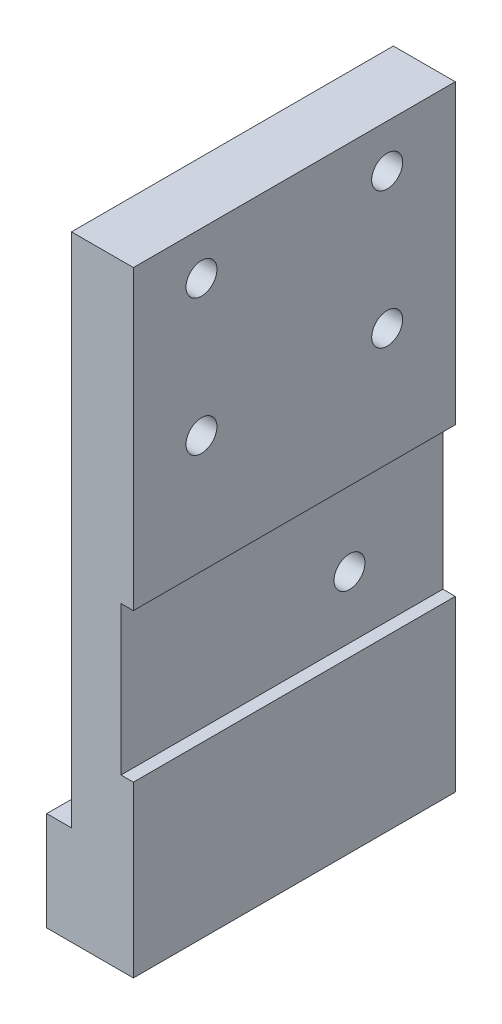
ISO-10303-21;
HEADER;
FILE_DESCRIPTION(('STEP AP214'),'2;1');
FILE_NAME('part.step','',(''),(''),'','','');
FILE_SCHEMA(('AUTOMOTIVE_DESIGN { 1 0 10303 214 1 1 1 1 }'));
ENDSEC;
DATA;
#1=APPLICATION_CONTEXT('core data for automotive mechanical design processes');
#2=APPLICATION_PROTOCOL_DEFINITION('international standard','automotive_design',2000,#1);
#3=PRODUCT_CONTEXT('',#1,'mechanical');
#4=PRODUCT('Part','Part','',(#3));
#5=PRODUCT_RELATED_PRODUCT_CATEGORY('part','',(#4));
#6=PRODUCT_DEFINITION_FORMATION('','',#4);
#7=PRODUCT_DEFINITION_CONTEXT('part definition',#1,'design');
#8=PRODUCT_DEFINITION('design','',#6,#7);
#9=PRODUCT_DEFINITION_SHAPE('','',#8);
#10=(LENGTH_UNIT() NAMED_UNIT(*) SI_UNIT(.MILLI.,.METRE.));
#11=(NAMED_UNIT(*) PLANE_ANGLE_UNIT() SI_UNIT($,.RADIAN.));
#12=(NAMED_UNIT(*) SI_UNIT($,.STERADIAN.) SOLID_ANGLE_UNIT());
#13=UNCERTAINTY_MEASURE_WITH_UNIT(LENGTH_MEASURE(1.E-05),#10,'distance_accuracy_value','');
#14=(GEOMETRIC_REPRESENTATION_CONTEXT(3) GLOBAL_UNCERTAINTY_ASSIGNED_CONTEXT((#13)) GLOBAL_UNIT_ASSIGNED_CONTEXT((#10,
#11,#12)) REPRESENTATION_CONTEXT('',''));
#15=CARTESIAN_POINT('',(0.,0.,0.));
#16=DIRECTION('',(0.,0.,1.));
#17=DIRECTION('',(1.,0.,0.));
#18=AXIS2_PLACEMENT_3D('',#15,#16,#17);
#19=CARTESIAN_POINT('',(22.4,54.,5.));
#20=DIRECTION('',(-1.,0.,0.));
#21=DIRECTION('',(0.,-1.,0.));
#22=AXIS2_PLACEMENT_3D('',#19,#20,#21);
#23=PLANE('',#22);
#24=DIRECTION('',(0.,-1.,0.));
#25=VECTOR('',#24,1.);
#26=CARTESIAN_POINT('',(22.4,36.7,-10.5));
#27=LINE('',#26,#25);
#28=CARTESIAN_POINT('',(22.4,18.7,-10.5));
#29=VERTEX_POINT('',#28);
#30=CARTESIAN_POINT('',(22.4,5.00000000000001,-10.5));
#31=VERTEX_POINT('',#30);
#32=EDGE_CURVE('E215',#29,#31,#27,.T.);
#33=ORIENTED_EDGE('',*,*,#32,.F.);
#34=DIRECTION('',(0.,0.,-1.));
#35=VECTOR('',#34,1.);
#36=CARTESIAN_POINT('',(22.4,18.7,-10.5));
#37=LINE('',#36,#35);
#38=CARTESIAN_POINT('',(22.4,18.7,15.5));
#39=VERTEX_POINT('',#38);
#40=EDGE_CURVE('E135',#39,#29,#37,.T.);
#41=ORIENTED_EDGE('',*,*,#40,.F.);
#42=DIRECTION('',(0.,1.,0.));
#43=VECTOR('',#42,1.);
#44=CARTESIAN_POINT('',(22.4,36.7,15.5));
#45=LINE('',#44,#43);
#46=CARTESIAN_POINT('',(22.4,5.00000000000001,15.5));
#47=VERTEX_POINT('',#46);
#48=EDGE_CURVE('E212',#47,#39,#45,.T.);
#49=ORIENTED_EDGE('',*,*,#48,.F.);
#50=DIRECTION('',(0.,0.,1.));
#51=VECTOR('',#50,1.);
#52=CARTESIAN_POINT('',(22.4,5.00000000000001,15.5));
#53=LINE('',#52,#51);
#54=EDGE_CURVE('E179',#31,#47,#53,.T.);
#55=ORIENTED_EDGE('',*,*,#54,.F.);
#56=EDGE_LOOP('',(#33,#41,#49,#55));
#57=FACE_BOUND('',#56,.T.);
#58=ADVANCED_FACE('F37',(#57),#23,.F.);
#59=CARTESIAN_POINT('',(17.4,54.,5.));
#60=DIRECTION('',(1.,0.,0.));
#61=DIRECTION('',(0.,1.,0.));
#62=AXIS2_PLACEMENT_3D('',#59,#60,#61);
#63=PLANE('',#62);
#64=CARTESIAN_POINT('',(17.4,23.7,-2.95567288440379));
#65=DIRECTION('',(1.,0.,0.));
#66=DIRECTION('',(0.,1.,0.));
#67=AXIS2_PLACEMENT_3D('',#64,#65,#66);
#68=CIRCLE('',#67,1.25);
#69=CARTESIAN_POINT('',(17.4,24.95,-2.95567288440379));
#70=VERTEX_POINT('',#69);
#71=EDGE_CURVE('E234',#70,#70,#68,.T.);
#72=ORIENTED_EDGE('',*,*,#71,.T.);
#73=EDGE_LOOP('',(#72));
#74=FACE_BOUND('',#73,.T.);
#75=CARTESIAN_POINT('',(17.4,51.1999999999982,10.));
#76=DIRECTION('',(1.,0.,0.));
#77=DIRECTION('',(0.,1.,0.));
#78=AXIS2_PLACEMENT_3D('',#75,#76,#77);
#79=CIRCLE('',#78,1.25);
#80=CARTESIAN_POINT('',(17.4,52.4499999999982,10.));
#81=VERTEX_POINT('',#80);
#82=EDGE_CURVE('E208',#81,#81,#79,.T.);
#83=ORIENTED_EDGE('',*,*,#82,.T.);
#84=EDGE_LOOP('',(#83));
#85=FACE_BOUND('',#84,.T.);
#86=CARTESIAN_POINT('',(17.4,51.1999999999982,-4.99999999999999));
#87=DIRECTION('',(1.,0.,0.));
#88=DIRECTION('',(0.,1.,0.));
#89=AXIS2_PLACEMENT_3D('',#86,#87,#88);
#90=CIRCLE('',#89,1.25);
#91=CARTESIAN_POINT('',(17.4,52.4499999999982,-4.99999999999999));
#92=VERTEX_POINT('',#91);
#93=EDGE_CURVE('E202',#92,#92,#90,.T.);
#94=ORIENTED_EDGE('',*,*,#93,.T.);
#95=EDGE_LOOP('',(#94));
#96=FACE_BOUND('',#95,.T.);
#97=CARTESIAN_POINT('',(17.4,40.1999999999982,-4.99999999999998));
#98=DIRECTION('',(1.,0.,0.));
#99=DIRECTION('',(0.,1.,0.));
#100=AXIS2_PLACEMENT_3D('',#97,#98,#99);
#101=CIRCLE('',#100,1.25);
#102=CARTESIAN_POINT('',(17.4,41.4499999999982,-4.99999999999998));
#103=VERTEX_POINT('',#102);
#104=EDGE_CURVE('E196',#103,#103,#101,.T.);
#105=ORIENTED_EDGE('',*,*,#104,.T.);
#106=EDGE_LOOP('',(#105));
#107=FACE_BOUND('',#106,.T.);
#108=CARTESIAN_POINT('',(17.4,40.1999999999982,10.));
#109=DIRECTION('',(1.,0.,0.));
#110=DIRECTION('',(0.,1.,0.));
#111=AXIS2_PLACEMENT_3D('',#108,#109,#110);
#112=CIRCLE('',#111,1.25);
#113=CARTESIAN_POINT('',(17.4,41.4499999999982,10.));
#114=VERTEX_POINT('',#113);
#115=EDGE_CURVE('E190',#114,#114,#112,.T.);
#116=ORIENTED_EDGE('',*,*,#115,.T.);
#117=EDGE_LOOP('',(#116));
#118=FACE_BOUND('',#117,.T.);
#119=DIRECTION('',(0.,0.,-1.));
#120=VECTOR('',#119,1.);
#121=CARTESIAN_POINT('',(17.4,13.,15.5));
#122=LINE('',#121,#120);
#123=CARTESIAN_POINT('',(17.4,13.,15.5));
#124=VERTEX_POINT('',#123);
#125=CARTESIAN_POINT('',(17.4,13.,-10.5));
#126=VERTEX_POINT('',#125);
#127=EDGE_CURVE('E60',#124,#126,#122,.T.);
#128=ORIENTED_EDGE('',*,*,#127,.F.);
#129=DIRECTION('',(0.,1.,0.));
#130=VECTOR('',#129,1.);
#131=CARTESIAN_POINT('',(17.4,36.7,15.5));
#132=LINE('',#131,#130);
#133=CARTESIAN_POINT('',(17.4,54.7,15.5));
#134=VERTEX_POINT('',#133);
#135=EDGE_CURVE('E211',#124,#134,#132,.T.);
#136=ORIENTED_EDGE('',*,*,#135,.T.);
#137=DIRECTION('',(0.,0.,1.));
#138=VECTOR('',#137,1.);
#139=CARTESIAN_POINT('',(17.4,54.7,5.));
#140=LINE('',#139,#138);
#141=CARTESIAN_POINT('',(17.4,54.7,-10.5));
#142=VERTEX_POINT('',#141);
#143=EDGE_CURVE('E11',#142,#134,#140,.T.);
#144=ORIENTED_EDGE('',*,*,#143,.F.);
#145=DIRECTION('',(0.,-1.,0.));
#146=VECTOR('',#145,1.);
#147=CARTESIAN_POINT('',(17.4,36.7,-10.5));
#148=LINE('',#147,#146);
#149=EDGE_CURVE('E220',#142,#126,#148,.T.);
#150=ORIENTED_EDGE('',*,*,#149,.T.);
#151=EDGE_LOOP('',(#128,#136,#144,#150));
#152=FACE_BOUND('',#151,.T.);
#153=ADVANCED_FACE('F263',(#74,#85,#96,#107,#118,#152),#63,.F.);
#154=CARTESIAN_POINT('',(22.4,40.1999999999982,10.));
#155=DIRECTION('',(1.,0.,0.));
#156=DIRECTION('',(0.,0.,-1.));
#157=AXIS2_PLACEMENT_3D('',#154,#155,#156);
#158=CIRCLE('',#157,1.25);
#159=CARTESIAN_POINT('',(22.4,40.1999999999982,8.75000000000001));
#160=VERTEX_POINT('',#159);
#161=EDGE_CURVE('E187',#160,#160,#158,.T.);
#162=ORIENTED_EDGE('',*,*,#161,.F.);
#163=EDGE_LOOP('',(#162));
#164=FACE_BOUND('',#163,.T.);
#165=CARTESIAN_POINT('',(22.4,40.1999999999982,-4.99999999999998));
#166=DIRECTION('',(1.,0.,0.));
#167=DIRECTION('',(0.,0.,-1.));
#168=AXIS2_PLACEMENT_3D('',#165,#166,#167);
#169=CIRCLE('',#168,1.25);
#170=CARTESIAN_POINT('',(22.4,40.1999999999982,-6.24999999999998));
#171=VERTEX_POINT('',#170);
#172=EDGE_CURVE('E193',#171,#171,#169,.T.);
#173=ORIENTED_EDGE('',*,*,#172,.F.);
#174=EDGE_LOOP('',(#173));
#175=FACE_BOUND('',#174,.T.);
#176=CARTESIAN_POINT('',(22.4,51.1999999999982,-4.99999999999999));
#177=DIRECTION('',(1.,0.,0.));
#178=DIRECTION('',(0.,0.,-1.));
#179=AXIS2_PLACEMENT_3D('',#176,#177,#178);
#180=CIRCLE('',#179,1.25);
#181=CARTESIAN_POINT('',(22.4,51.1999999999982,-6.24999999999999));
#182=VERTEX_POINT('',#181);
#183=EDGE_CURVE('E199',#182,#182,#180,.T.);
#184=ORIENTED_EDGE('',*,*,#183,.F.);
#185=EDGE_LOOP('',(#184));
#186=FACE_BOUND('',#185,.T.);
#187=CARTESIAN_POINT('',(22.4,51.1999999999982,10.));
#188=DIRECTION('',(1.,0.,0.));
#189=DIRECTION('',(0.,0.,-1.));
#190=AXIS2_PLACEMENT_3D('',#187,#188,#189);
#191=CIRCLE('',#190,1.25);
#192=CARTESIAN_POINT('',(22.4,51.1999999999982,8.75000000000001));
#193=VERTEX_POINT('',#192);
#194=EDGE_CURVE('E205',#193,#193,#191,.T.);
#195=ORIENTED_EDGE('',*,*,#194,.F.);
#196=EDGE_LOOP('',(#195));
#197=FACE_BOUND('',#196,.T.);
#198=CARTESIAN_POINT('',(22.4,30.7,15.5));
#199=VERTEX_POINT('',#198);
#200=CARTESIAN_POINT('',(22.4,54.7,15.5));
#201=VERTEX_POINT('',#200);
#202=EDGE_CURVE('E216',#199,#201,#45,.T.);
#203=ORIENTED_EDGE('',*,*,#202,.F.);
#204=DIRECTION('',(0.,0.,1.));
#205=VECTOR('',#204,1.);
#206=CARTESIAN_POINT('',(22.4,30.7,-10.5));
#207=LINE('',#206,#205);
#208=CARTESIAN_POINT('',(22.4,30.7,-10.5));
#209=VERTEX_POINT('',#208);
#210=EDGE_CURVE('E233',#209,#199,#207,.T.);
#211=ORIENTED_EDGE('',*,*,#210,.F.);
#212=CARTESIAN_POINT('',(22.4,54.7,-10.5));
#213=VERTEX_POINT('',#212);
#214=EDGE_CURVE('E141',#213,#209,#27,.T.);
#215=ORIENTED_EDGE('',*,*,#214,.F.);
#216=DIRECTION('',(0.,0.,-1.));
#217=VECTOR('',#216,1.);
#218=CARTESIAN_POINT('',(22.4,54.7,5.));
#219=LINE('',#218,#217);
#220=EDGE_CURVE('E45',#201,#213,#219,.T.);
#221=ORIENTED_EDGE('',*,*,#220,.F.);
#222=EDGE_LOOP('',(#203,#211,#215,#221));
#223=FACE_BOUND('',#222,.T.);
#224=ADVANCED_FACE('F39',(#164,#175,#186,#197,#223),#23,.F.);
#225=CARTESIAN_POINT('',(0.,54.7,0.));
#226=DIRECTION('',(0.,1.,0.));
#227=DIRECTION('',(0.,0.,1.));
#228=AXIS2_PLACEMENT_3D('',#225,#226,#227);
#229=PLANE('',#228);
#230=ORIENTED_EDGE('',*,*,#220,.T.);
#231=DIRECTION('',(-1.,0.,0.));
#232=VECTOR('',#231,1.);
#233=CARTESIAN_POINT('',(22.4,54.7,-10.5));
#234=LINE('',#233,#232);
#235=EDGE_CURVE('E222',#213,#142,#234,.T.);
#236=ORIENTED_EDGE('',*,*,#235,.T.);
#237=ORIENTED_EDGE('',*,*,#143,.T.);
#238=DIRECTION('',(-1.,0.,0.));
#239=VECTOR('',#238,1.);
#240=CARTESIAN_POINT('',(22.4,54.7,15.5));
#241=LINE('',#240,#239);
#242=EDGE_CURVE('E218',#201,#134,#241,.T.);
#243=ORIENTED_EDGE('',*,*,#242,.F.);
#244=EDGE_LOOP('',(#230,#236,#237,#243));
#245=FACE_BOUND('',#244,.T.);
#246=ADVANCED_FACE('F229',(#245),#229,.T.);
#247=CARTESIAN_POINT('',(22.4,36.7,-10.5));
#248=DIRECTION('',(0.,0.,-1.));
#249=DIRECTION('',(-1.,0.,0.));
#250=AXIS2_PLACEMENT_3D('',#247,#248,#249);
#251=PLANE('',#250);
#252=DIRECTION('',(1.,0.,0.));
#253=VECTOR('',#252,1.);
#254=CARTESIAN_POINT('',(21.4,18.7,-10.5));
#255=LINE('',#254,#253);
#256=CARTESIAN_POINT('',(21.4,18.7,-10.5));
#257=VERTEX_POINT('',#256);
#258=EDGE_CURVE('E152',#257,#29,#255,.T.);
#259=ORIENTED_EDGE('',*,*,#258,.T.);
#260=ORIENTED_EDGE('',*,*,#32,.T.);
#261=DIRECTION('',(1.,0.,0.));
#262=VECTOR('',#261,1.);
#263=CARTESIAN_POINT('',(22.4,5.00000000000001,-10.5));
#264=LINE('',#263,#262);
#265=CARTESIAN_POINT('',(15.4,5.00000000000001,-10.5));
#266=VERTEX_POINT('',#265);
#267=EDGE_CURVE('E184',#266,#31,#264,.T.);
#268=ORIENTED_EDGE('',*,*,#267,.F.);
#269=DIRECTION('',(0.,-1.,0.));
#270=VECTOR('',#269,1.);
#271=CARTESIAN_POINT('',(15.4,5.00000000000001,-10.5));
#272=LINE('',#271,#270);
#273=CARTESIAN_POINT('',(15.4,13.,-10.5));
#274=VERTEX_POINT('',#273);
#275=EDGE_CURVE('E166',#274,#266,#272,.T.);
#276=ORIENTED_EDGE('',*,*,#275,.F.);
#277=DIRECTION('',(1.,0.,0.));
#278=VECTOR('',#277,1.);
#279=CARTESIAN_POINT('',(15.4,13.,-10.5));
#280=LINE('',#279,#278);
#281=EDGE_CURVE('E172',#274,#126,#280,.T.);
#282=ORIENTED_EDGE('',*,*,#281,.T.);
#283=ORIENTED_EDGE('',*,*,#149,.F.);
#284=ORIENTED_EDGE('',*,*,#235,.F.);
#285=ORIENTED_EDGE('',*,*,#214,.T.);
#286=DIRECTION('',(1.,0.,0.));
#287=VECTOR('',#286,1.);
#288=CARTESIAN_POINT('',(21.4,30.7,-10.5));
#289=LINE('',#288,#287);
#290=CARTESIAN_POINT('',(21.4,30.7,-10.5));
#291=VERTEX_POINT('',#290);
#292=EDGE_CURVE('E120',#291,#209,#289,.T.);
#293=ORIENTED_EDGE('',*,*,#292,.F.);
#294=DIRECTION('',(0.,1.,0.));
#295=VECTOR('',#294,1.);
#296=CARTESIAN_POINT('',(21.4,18.7,-10.5));
#297=LINE('',#296,#295);
#298=EDGE_CURVE('E126',#257,#291,#297,.T.);
#299=ORIENTED_EDGE('',*,*,#298,.F.);
#300=EDGE_LOOP('',(#259,#260,#268,#276,#282,#283,#284,#285,#293,#299));
#301=FACE_BOUND('',#300,.T.);
#302=ADVANCED_FACE('F138',(#301),#251,.T.);
#303=CARTESIAN_POINT('',(22.4,36.7,15.5));
#304=DIRECTION('',(0.,0.,1.));
#305=DIRECTION('',(0.,-1.,0.));
#306=AXIS2_PLACEMENT_3D('',#303,#304,#305);
#307=PLANE('',#306);
#308=DIRECTION('',(1.,0.,0.));
#309=VECTOR('',#308,1.);
#310=CARTESIAN_POINT('',(21.4,18.7,15.5));
#311=LINE('',#310,#309);
#312=CARTESIAN_POINT('',(21.4,18.7,15.5));
#313=VERTEX_POINT('',#312);
#314=EDGE_CURVE('E143',#313,#39,#311,.T.);
#315=ORIENTED_EDGE('',*,*,#314,.F.);
#316=DIRECTION('',(0.,-1.,0.));
#317=VECTOR('',#316,1.);
#318=CARTESIAN_POINT('',(21.4,18.7,15.5));
#319=LINE('',#318,#317);
#320=CARTESIAN_POINT('',(21.4,30.7,15.5));
#321=VERTEX_POINT('',#320);
#322=EDGE_CURVE('E125',#321,#313,#319,.T.);
#323=ORIENTED_EDGE('',*,*,#322,.F.);
#324=DIRECTION('',(1.,0.,0.));
#325=VECTOR('',#324,1.);
#326=CARTESIAN_POINT('',(21.4,30.7,15.5));
#327=LINE('',#326,#325);
#328=EDGE_CURVE('E123',#321,#199,#327,.T.);
#329=ORIENTED_EDGE('',*,*,#328,.T.);
#330=ORIENTED_EDGE('',*,*,#202,.T.);
#331=ORIENTED_EDGE('',*,*,#242,.T.);
#332=ORIENTED_EDGE('',*,*,#135,.F.);
#333=DIRECTION('',(1.,0.,0.));
#334=VECTOR('',#333,1.);
#335=CARTESIAN_POINT('',(15.4,13.,15.5));
#336=LINE('',#335,#334);
#337=CARTESIAN_POINT('',(15.4,13.,15.5));
#338=VERTEX_POINT('',#337);
#339=EDGE_CURVE('E176',#338,#124,#336,.T.);
#340=ORIENTED_EDGE('',*,*,#339,.F.);
#341=DIRECTION('',(0.,1.,0.));
#342=VECTOR('',#341,1.);
#343=CARTESIAN_POINT('',(15.4,5.00000000000001,15.5));
#344=LINE('',#343,#342);
#345=CARTESIAN_POINT('',(15.4,5.00000000000001,15.5));
#346=VERTEX_POINT('',#345);
#347=EDGE_CURVE('E161',#346,#338,#344,.T.);
#348=ORIENTED_EDGE('',*,*,#347,.F.);
#349=DIRECTION('',(-1.,0.,0.));
#350=VECTOR('',#349,1.);
#351=CARTESIAN_POINT('',(22.4,5.00000000000001,15.5));
#352=LINE('',#351,#350);
#353=EDGE_CURVE('E182',#47,#346,#352,.T.);
#354=ORIENTED_EDGE('',*,*,#353,.F.);
#355=ORIENTED_EDGE('',*,*,#48,.T.);
#356=EDGE_LOOP('',(#315,#323,#329,#330,#331,#332,#340,#348,#354,#355));
#357=FACE_BOUND('',#356,.T.);
#358=ADVANCED_FACE('F251',(#357),#307,.T.);
#359=CARTESIAN_POINT('',(22.4,51.1999999999982,10.));
#360=DIRECTION('',(1.,0.,0.));
#361=DIRECTION('',(0.,0.,-1.));
#362=AXIS2_PLACEMENT_3D('',#359,#360,#361);
#363=CYLINDRICAL_SURFACE('',#362,1.25);
#364=ORIENTED_EDGE('',*,*,#194,.T.);
#365=EDGE_LOOP('',(#364));
#366=FACE_BOUND('',#365,.T.);
#367=ORIENTED_EDGE('',*,*,#82,.F.);
#368=EDGE_LOOP('',(#367));
#369=FACE_BOUND('',#368,.T.);
#370=ADVANCED_FACE('F279',(#366,#369),#363,.F.);
#371=CARTESIAN_POINT('',(22.4,51.1999999999982,-4.99999999999999));
#372=DIRECTION('',(1.,0.,0.));
#373=DIRECTION('',(0.,0.,-1.));
#374=AXIS2_PLACEMENT_3D('',#371,#372,#373);
#375=CYLINDRICAL_SURFACE('',#374,1.25);
#376=ORIENTED_EDGE('',*,*,#183,.T.);
#377=EDGE_LOOP('',(#376));
#378=FACE_BOUND('',#377,.T.);
#379=ORIENTED_EDGE('',*,*,#93,.F.);
#380=EDGE_LOOP('',(#379));
#381=FACE_BOUND('',#380,.T.);
#382=ADVANCED_FACE('F284',(#378,#381),#375,.F.);
#383=CARTESIAN_POINT('',(22.4,40.1999999999982,-4.99999999999998));
#384=DIRECTION('',(1.,0.,0.));
#385=DIRECTION('',(0.,0.,-1.));
#386=AXIS2_PLACEMENT_3D('',#383,#384,#385);
#387=CYLINDRICAL_SURFACE('',#386,1.25);
#388=ORIENTED_EDGE('',*,*,#172,.T.);
#389=EDGE_LOOP('',(#388));
#390=FACE_BOUND('',#389,.T.);
#391=ORIENTED_EDGE('',*,*,#104,.F.);
#392=EDGE_LOOP('',(#391));
#393=FACE_BOUND('',#392,.T.);
#394=ADVANCED_FACE('F288',(#390,#393),#387,.F.);
#395=CARTESIAN_POINT('',(22.4,40.1999999999982,10.));
#396=DIRECTION('',(1.,0.,0.));
#397=DIRECTION('',(0.,0.,-1.));
#398=AXIS2_PLACEMENT_3D('',#395,#396,#397);
#399=CYLINDRICAL_SURFACE('',#398,1.25);
#400=ORIENTED_EDGE('',*,*,#161,.T.);
#401=EDGE_LOOP('',(#400));
#402=FACE_BOUND('',#401,.T.);
#403=ORIENTED_EDGE('',*,*,#115,.F.);
#404=EDGE_LOOP('',(#403));
#405=FACE_BOUND('',#404,.T.);
#406=ADVANCED_FACE('F292',(#402,#405),#399,.F.);
#407=CARTESIAN_POINT('',(0.,5.00000000000001,0.));
#408=DIRECTION('',(0.,1.,0.));
#409=DIRECTION('',(0.,0.,1.));
#410=AXIS2_PLACEMENT_3D('',#407,#408,#409);
#411=PLANE('',#410);
#412=CARTESIAN_POINT('',(18.9,5.00000000000001,7.64050696406167));
#413=DIRECTION('',(0.,-1.,0.));
#414=DIRECTION('',(0.,0.,-1.));
#415=AXIS2_PLACEMENT_3D('',#412,#413,#414);
#416=CIRCLE('',#415,1.65);
#417=CARTESIAN_POINT('',(18.9,5.00000000000001,5.99050696406167));
#418=VERTEX_POINT('',#417);
#419=EDGE_CURVE('E148',#418,#418,#416,.T.);
#420=ORIENTED_EDGE('',*,*,#419,.F.);
#421=EDGE_LOOP('',(#420));
#422=FACE_BOUND('',#421,.T.);
#423=CARTESIAN_POINT('',(18.9,5.00000000000001,-3.35949303593833));
#424=DIRECTION('',(0.,-1.,0.));
#425=DIRECTION('',(0.,0.,-1.));
#426=AXIS2_PLACEMENT_3D('',#423,#424,#425);
#427=CIRCLE('',#426,1.65);
#428=CARTESIAN_POINT('',(18.9,5.00000000000001,-5.00949303593833));
#429=VERTEX_POINT('',#428);
#430=EDGE_CURVE('E155',#429,#429,#427,.T.);
#431=ORIENTED_EDGE('',*,*,#430,.F.);
#432=EDGE_LOOP('',(#431));
#433=FACE_BOUND('',#432,.T.);
#434=ORIENTED_EDGE('',*,*,#54,.T.);
#435=ORIENTED_EDGE('',*,*,#353,.T.);
#436=DIRECTION('',(0.,0.,1.));
#437=VECTOR('',#436,1.);
#438=CARTESIAN_POINT('',(15.4,5.00000000000001,15.5));
#439=LINE('',#438,#437);
#440=EDGE_CURVE('E169',#266,#346,#439,.T.);
#441=ORIENTED_EDGE('',*,*,#440,.F.);
#442=ORIENTED_EDGE('',*,*,#267,.T.);
#443=EDGE_LOOP('',(#434,#435,#441,#442));
#444=FACE_BOUND('',#443,.T.);
#445=ADVANCED_FACE('F256',(#422,#433,#444),#411,.F.);
#446=CARTESIAN_POINT('',(15.4,13.,15.5));
#447=DIRECTION('',(0.,-1.,0.));
#448=DIRECTION('',(1.,0.,0.));
#449=AXIS2_PLACEMENT_3D('',#446,#447,#448);
#450=PLANE('',#449);
#451=ORIENTED_EDGE('',*,*,#127,.T.);
#452=ORIENTED_EDGE('',*,*,#281,.F.);
#453=DIRECTION('',(0.,0.,-1.));
#454=VECTOR('',#453,1.);
#455=CARTESIAN_POINT('',(15.4,13.,15.5));
#456=LINE('',#455,#454);
#457=EDGE_CURVE('E164',#338,#274,#456,.T.);
#458=ORIENTED_EDGE('',*,*,#457,.F.);
#459=ORIENTED_EDGE('',*,*,#339,.T.);
#460=EDGE_LOOP('',(#451,#452,#458,#459));
#461=FACE_BOUND('',#460,.T.);
#462=ADVANCED_FACE('F262',(#461),#450,.F.);
#463=CARTESIAN_POINT('',(15.4,0.,0.));
#464=DIRECTION('',(-1.,0.,0.));
#465=DIRECTION('',(0.,0.,1.));
#466=AXIS2_PLACEMENT_3D('',#463,#464,#465);
#467=PLANE('',#466);
#468=ORIENTED_EDGE('',*,*,#347,.T.);
#469=ORIENTED_EDGE('',*,*,#457,.T.);
#470=ORIENTED_EDGE('',*,*,#275,.T.);
#471=ORIENTED_EDGE('',*,*,#440,.T.);
#472=EDGE_LOOP('',(#468,#469,#470,#471));
#473=FACE_BOUND('',#472,.T.);
#474=ADVANCED_FACE('F259',(#473),#467,.T.);
#475=CARTESIAN_POINT('',(18.9,11.,-3.35949303593833));
#476=DIRECTION('',(0.,-1.,0.));
#477=DIRECTION('',(0.,0.,-1.));
#478=AXIS2_PLACEMENT_3D('',#475,#476,#477);
#479=CONICAL_SURFACE('',#478,1.65,1.02974425867666);
#480=CARTESIAN_POINT('',(18.9,11.9914200213955,-3.35949303593833));
#481=VERTEX_POINT('',#480);
#482=VERTEX_LOOP('',#481);
#483=FACE_BOUND('',#482,.T.);
#484=CARTESIAN_POINT('',(18.9,11.,-3.35949303593833));
#485=DIRECTION('',(0.,-1.,0.));
#486=DIRECTION('',(0.,0.,-1.));
#487=AXIS2_PLACEMENT_3D('',#484,#485,#486);
#488=CIRCLE('',#487,1.65);
#489=CARTESIAN_POINT('',(18.9,11.,-5.00949303593833));
#490=VERTEX_POINT('',#489);
#491=EDGE_CURVE('E158',#490,#490,#488,.T.);
#492=ORIENTED_EDGE('',*,*,#491,.T.);
#493=EDGE_LOOP('',(#492));
#494=FACE_BOUND('',#493,.T.);
#495=ADVANCED_FACE('F304',(#483,#494),#479,.F.);
#496=CARTESIAN_POINT('',(18.9,5.00000000000001,-3.35949303593833));
#497=DIRECTION('',(0.,-1.,0.));
#498=DIRECTION('',(0.,0.,-1.));
#499=AXIS2_PLACEMENT_3D('',#496,#497,#498);
#500=CYLINDRICAL_SURFACE('',#499,1.65);
#501=ORIENTED_EDGE('',*,*,#491,.F.);
#502=EDGE_LOOP('',(#501));
#503=FACE_BOUND('',#502,.T.);
#504=ORIENTED_EDGE('',*,*,#430,.T.);
#505=EDGE_LOOP('',(#504));
#506=FACE_BOUND('',#505,.T.);
#507=ADVANCED_FACE('F307',(#503,#506),#500,.F.);
#508=CARTESIAN_POINT('',(18.9,11.,7.64050696406167));
#509=DIRECTION('',(0.,-1.,0.));
#510=DIRECTION('',(0.,0.,-1.));
#511=AXIS2_PLACEMENT_3D('',#508,#509,#510);
#512=CONICAL_SURFACE('',#511,1.65,1.02974425867666);
#513=CARTESIAN_POINT('',(18.9,11.9914200213955,7.64050696406167));
#514=VERTEX_POINT('',#513);
#515=VERTEX_LOOP('',#514);
#516=FACE_BOUND('',#515,.T.);
#517=CARTESIAN_POINT('',(18.9,11.,7.64050696406167));
#518=DIRECTION('',(0.,-1.,0.));
#519=DIRECTION('',(0.,0.,-1.));
#520=AXIS2_PLACEMENT_3D('',#517,#518,#519);
#521=CIRCLE('',#520,1.65);
#522=CARTESIAN_POINT('',(18.9,11.,5.99050696406167));
#523=VERTEX_POINT('',#522);
#524=EDGE_CURVE('E151',#523,#523,#521,.T.);
#525=ORIENTED_EDGE('',*,*,#524,.T.);
#526=EDGE_LOOP('',(#525));
#527=FACE_BOUND('',#526,.T.);
#528=ADVANCED_FACE('F311',(#516,#527),#512,.F.);
#529=CARTESIAN_POINT('',(18.9,5.00000000000001,7.64050696406167));
#530=DIRECTION('',(0.,-1.,0.));
#531=DIRECTION('',(0.,0.,-1.));
#532=AXIS2_PLACEMENT_3D('',#529,#530,#531);
#533=CYLINDRICAL_SURFACE('',#532,1.65);
#534=ORIENTED_EDGE('',*,*,#524,.F.);
#535=EDGE_LOOP('',(#534));
#536=FACE_BOUND('',#535,.T.);
#537=ORIENTED_EDGE('',*,*,#419,.T.);
#538=EDGE_LOOP('',(#537));
#539=FACE_BOUND('',#538,.T.);
#540=ADVANCED_FACE('F315',(#536,#539),#533,.F.);
#541=CARTESIAN_POINT('',(21.4,18.7,-10.5));
#542=DIRECTION('',(0.,-1.,0.));
#543=DIRECTION('',(0.,0.,-1.));
#544=AXIS2_PLACEMENT_3D('',#541,#542,#543);
#545=PLANE('',#544);
#546=ORIENTED_EDGE('',*,*,#40,.T.);
#547=ORIENTED_EDGE('',*,*,#258,.F.);
#548=DIRECTION('',(0.,0.,-1.));
#549=VECTOR('',#548,1.);
#550=CARTESIAN_POINT('',(21.4,18.7,-10.5));
#551=LINE('',#550,#549);
#552=EDGE_CURVE('E132',#313,#257,#551,.T.);
#553=ORIENTED_EDGE('',*,*,#552,.F.);
#554=ORIENTED_EDGE('',*,*,#314,.T.);
#555=EDGE_LOOP('',(#546,#547,#553,#554));
#556=FACE_BOUND('',#555,.T.);
#557=ADVANCED_FACE('F245',(#556),#545,.F.);
#558=CARTESIAN_POINT('',(21.4,30.7,-10.5));
#559=DIRECTION('',(0.,1.,0.));
#560=DIRECTION('',(-1.,0.,0.));
#561=AXIS2_PLACEMENT_3D('',#558,#559,#560);
#562=PLANE('',#561);
#563=ORIENTED_EDGE('',*,*,#210,.T.);
#564=ORIENTED_EDGE('',*,*,#328,.F.);
#565=DIRECTION('',(0.,0.,1.));
#566=VECTOR('',#565,1.);
#567=CARTESIAN_POINT('',(21.4,30.7,-10.5));
#568=LINE('',#567,#566);
#569=EDGE_CURVE('E52',#291,#321,#568,.T.);
#570=ORIENTED_EDGE('',*,*,#569,.F.);
#571=ORIENTED_EDGE('',*,*,#292,.T.);
#572=EDGE_LOOP('',(#563,#564,#570,#571));
#573=FACE_BOUND('',#572,.T.);
#574=ADVANCED_FACE('F118',(#573),#562,.F.);
#575=CARTESIAN_POINT('',(21.4,0.,0.));
#576=DIRECTION('',(1.,0.,0.));
#577=DIRECTION('',(0.,1.,0.));
#578=AXIS2_PLACEMENT_3D('',#575,#576,#577);
#579=PLANE('',#578);
#580=CARTESIAN_POINT('',(21.4,23.7,-2.95567288440379));
#581=DIRECTION('',(1.,0.,0.));
#582=DIRECTION('',(0.,0.,-1.));
#583=AXIS2_PLACEMENT_3D('',#580,#581,#582);
#584=CIRCLE('',#583,1.25);
#585=CARTESIAN_POINT('',(21.4,23.7,-4.20567288440379));
#586=VERTEX_POINT('',#585);
#587=EDGE_CURVE('E238',#586,#586,#584,.T.);
#588=ORIENTED_EDGE('',*,*,#587,.F.);
#589=EDGE_LOOP('',(#588));
#590=FACE_BOUND('',#589,.T.);
#591=ORIENTED_EDGE('',*,*,#298,.T.);
#592=ORIENTED_EDGE('',*,*,#569,.T.);
#593=ORIENTED_EDGE('',*,*,#322,.T.);
#594=ORIENTED_EDGE('',*,*,#552,.T.);
#595=EDGE_LOOP('',(#591,#592,#593,#594));
#596=FACE_BOUND('',#595,.T.);
#597=ADVANCED_FACE('F130',(#590,#596),#579,.T.);
#598=CARTESIAN_POINT('',(21.4,23.7,-2.95567288440379));
#599=DIRECTION('',(1.,0.,0.));
#600=DIRECTION('',(0.,0.,-1.));
#601=AXIS2_PLACEMENT_3D('',#598,#599,#600);
#602=CYLINDRICAL_SURFACE('',#601,1.25);
#603=ORIENTED_EDGE('',*,*,#587,.T.);
#604=EDGE_LOOP('',(#603));
#605=FACE_BOUND('',#604,.T.);
#606=ORIENTED_EDGE('',*,*,#71,.F.);
#607=EDGE_LOOP('',(#606));
#608=FACE_BOUND('',#607,.T.);
#609=ADVANCED_FACE('F326',(#605,#608),#602,.F.);
#610=CLOSED_SHELL('',(#58,#153,#224,#246,#302,#358,#370,#382,#394,#406,#445,#462,#474,#495,#507,
#528,#540,#557,#574,#597,#609));
#611=MANIFOLD_SOLID_BREP('B2',#610);
#612=ADVANCED_BREP_SHAPE_REPRESENTATION('',(#18,#611),#14);
#613=SHAPE_DEFINITION_REPRESENTATION(#9,#612);
ENDSEC;
END-ISO-10303-21;
